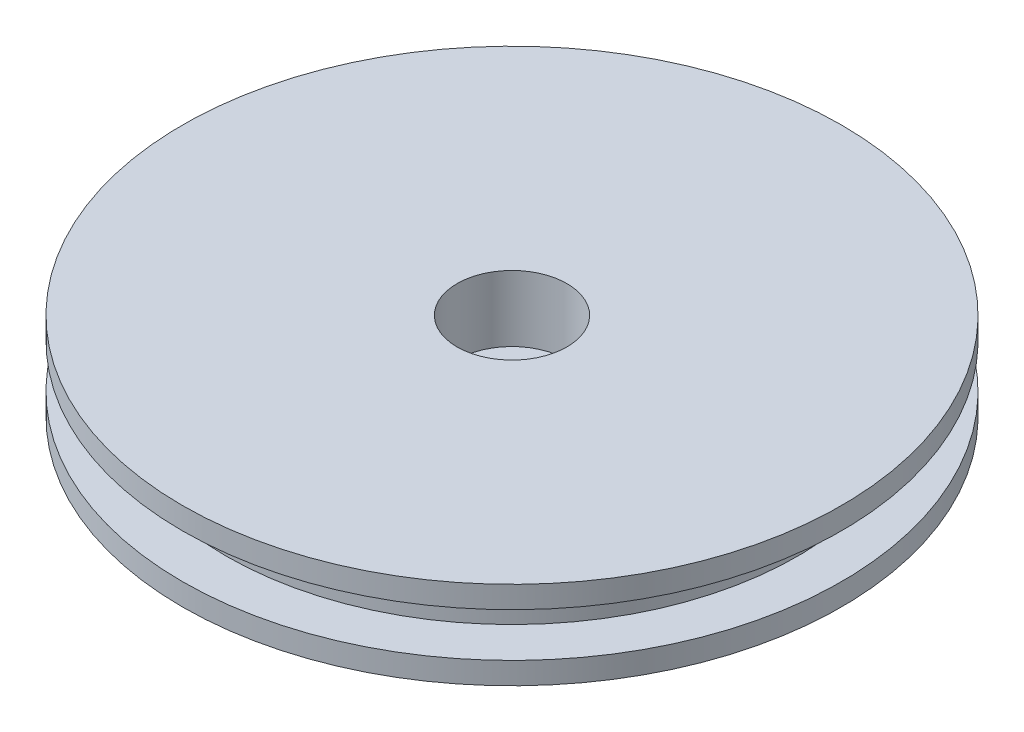
ISO-10303-21;
HEADER;
FILE_DESCRIPTION(('STEP AP214'),'2;1');
FILE_NAME('part.step','',(''),(''),'','','');
FILE_SCHEMA(('AUTOMOTIVE_DESIGN { 1 0 10303 214 1 1 1 1 }'));
ENDSEC;
DATA;
#1=APPLICATION_CONTEXT('core data for automotive mechanical design processes');
#2=APPLICATION_PROTOCOL_DEFINITION('international standard','automotive_design',2000,#1);
#3=PRODUCT_CONTEXT('',#1,'mechanical');
#4=PRODUCT('Part','Part','',(#3));
#5=PRODUCT_RELATED_PRODUCT_CATEGORY('part','',(#4));
#6=PRODUCT_DEFINITION_FORMATION('','',#4);
#7=PRODUCT_DEFINITION_CONTEXT('part definition',#1,'design');
#8=PRODUCT_DEFINITION('design','',#6,#7);
#9=PRODUCT_DEFINITION_SHAPE('','',#8);
#10=(LENGTH_UNIT() NAMED_UNIT(*) SI_UNIT(.MILLI.,.METRE.));
#11=(NAMED_UNIT(*) PLANE_ANGLE_UNIT() SI_UNIT($,.RADIAN.));
#12=(NAMED_UNIT(*) SI_UNIT($,.STERADIAN.) SOLID_ANGLE_UNIT());
#13=UNCERTAINTY_MEASURE_WITH_UNIT(LENGTH_MEASURE(1.E-05),#10,'distance_accuracy_value','');
#14=(GEOMETRIC_REPRESENTATION_CONTEXT(3) GLOBAL_UNCERTAINTY_ASSIGNED_CONTEXT((#13)) GLOBAL_UNIT_ASSIGNED_CONTEXT((#10,
#11,#12)) REPRESENTATION_CONTEXT('',''));
#15=CARTESIAN_POINT('',(0.,0.,0.));
#16=DIRECTION('',(0.,0.,1.));
#17=DIRECTION('',(1.,0.,0.));
#18=AXIS2_PLACEMENT_3D('',#15,#16,#17);
#19=CARTESIAN_POINT('',(0.,-2.,0.));
#20=DIRECTION('',(0.,-1.,0.));
#21=DIRECTION('',(0.,0.,-1.));
#22=AXIS2_PLACEMENT_3D('',#19,#20,#21);
#23=PLANE('',#22);
#24=CARTESIAN_POINT('',(0.,-2.,0.));
#25=DIRECTION('',(0.,1.,0.));
#26=DIRECTION('',(0.,0.,1.));
#27=AXIS2_PLACEMENT_3D('',#24,#25,#26);
#28=CIRCLE('',#27,1.50000000000001);
#29=CARTESIAN_POINT('',(0.,-2.,1.50000000000001));
#30=VERTEX_POINT('',#29);
#31=EDGE_CURVE('E58',#30,#30,#28,.T.);
#32=ORIENTED_EDGE('',*,*,#31,.T.);
#33=EDGE_LOOP('',(#32));
#34=FACE_BOUND('',#33,.T.);
#35=CARTESIAN_POINT('',(0.,-2.,0.));
#36=DIRECTION('',(0.,1.,0.));
#37=DIRECTION('',(0.,0.,1.));
#38=AXIS2_PLACEMENT_3D('',#35,#36,#37);
#39=CIRCLE('',#38,15.);
#40=CARTESIAN_POINT('',(0.,-2.,15.));
#41=VERTEX_POINT('',#40);
#42=EDGE_CURVE('E10',#41,#41,#39,.T.);
#43=ORIENTED_EDGE('',*,*,#42,.F.);
#44=EDGE_LOOP('',(#43));
#45=FACE_BOUND('',#44,.T.);
#46=ADVANCED_FACE('F33',(#34,#45),#23,.T.);
#47=CARTESIAN_POINT('',(0.,2.,0.));
#48=DIRECTION('',(0.,1.,0.));
#49=DIRECTION('',(0.,0.,1.));
#50=AXIS2_PLACEMENT_3D('',#47,#48,#49);
#51=CYLINDRICAL_SURFACE('',#50,15.);
#52=ORIENTED_EDGE('',*,*,#42,.T.);
#53=EDGE_LOOP('',(#52));
#54=FACE_BOUND('',#53,.T.);
#55=CARTESIAN_POINT('',(0.,-1.,0.));
#56=DIRECTION('',(0.,1.,0.));
#57=DIRECTION('',(0.,0.,1.));
#58=AXIS2_PLACEMENT_3D('',#55,#56,#57);
#59=CIRCLE('',#58,15.);
#60=CARTESIAN_POINT('',(0.,-0.999999999999998,15.));
#61=VERTEX_POINT('',#60);
#62=EDGE_CURVE('E39',#61,#61,#59,.T.);
#63=ORIENTED_EDGE('',*,*,#62,.F.);
#64=EDGE_LOOP('',(#63));
#65=FACE_BOUND('',#64,.T.);
#66=ADVANCED_FACE('F92',(#54,#65),#51,.T.);
#67=CARTESIAN_POINT('',(0.,-0.999999999999998,15.));
#68=DIRECTION('',(0.,1.,0.));
#69=DIRECTION('',(0.,0.,1.));
#70=AXIS2_PLACEMENT_3D('',#67,#68,#69);
#71=PLANE('',#70);
#72=ORIENTED_EDGE('',*,*,#62,.T.);
#73=EDGE_LOOP('',(#72));
#74=FACE_BOUND('',#73,.T.);
#75=CARTESIAN_POINT('',(0.,-1.,0.));
#76=DIRECTION('',(0.,1.,0.));
#77=DIRECTION('',(0.,0.,1.));
#78=AXIS2_PLACEMENT_3D('',#75,#76,#77);
#79=CIRCLE('',#78,13.);
#80=CARTESIAN_POINT('',(0.,-0.999999999999998,13.));
#81=VERTEX_POINT('',#80);
#82=EDGE_CURVE('E43',#81,#81,#79,.T.);
#83=ORIENTED_EDGE('',*,*,#82,.F.);
#84=EDGE_LOOP('',(#83));
#85=FACE_BOUND('',#84,.T.);
#86=ADVANCED_FACE('F97',(#74,#85),#71,.T.);
#87=CARTESIAN_POINT('',(0.,2.,0.));
#88=DIRECTION('',(0.,1.,0.));
#89=DIRECTION('',(0.,0.,1.));
#90=AXIS2_PLACEMENT_3D('',#87,#88,#89);
#91=CYLINDRICAL_SURFACE('',#90,13.);
#92=ORIENTED_EDGE('',*,*,#82,.T.);
#93=EDGE_LOOP('',(#92));
#94=FACE_BOUND('',#93,.T.);
#95=CARTESIAN_POINT('',(0.,0.999999999999995,0.));
#96=DIRECTION('',(0.,1.,0.));
#97=DIRECTION('',(0.,0.,1.));
#98=AXIS2_PLACEMENT_3D('',#95,#96,#97);
#99=CIRCLE('',#98,13.);
#100=CARTESIAN_POINT('',(0.,0.999999999999998,13.));
#101=VERTEX_POINT('',#100);
#102=EDGE_CURVE('E47',#101,#101,#99,.T.);
#103=ORIENTED_EDGE('',*,*,#102,.F.);
#104=EDGE_LOOP('',(#103));
#105=FACE_BOUND('',#104,.T.);
#106=ADVANCED_FACE('F88',(#94,#105),#91,.T.);
#107=CARTESIAN_POINT('',(0.,0.999999999999998,15.));
#108=DIRECTION('',(0.,-1.,0.));
#109=DIRECTION('',(0.,0.,-1.));
#110=AXIS2_PLACEMENT_3D('',#107,#108,#109);
#111=PLANE('',#110);
#112=ORIENTED_EDGE('',*,*,#102,.T.);
#113=EDGE_LOOP('',(#112));
#114=FACE_BOUND('',#113,.T.);
#115=CARTESIAN_POINT('',(0.,0.999999999999993,0.));
#116=DIRECTION('',(0.,1.,0.));
#117=DIRECTION('',(0.,0.,1.));
#118=AXIS2_PLACEMENT_3D('',#115,#116,#117);
#119=CIRCLE('',#118,15.);
#120=CARTESIAN_POINT('',(0.,0.999999999999997,15.));
#121=VERTEX_POINT('',#120);
#122=EDGE_CURVE('E52',#121,#121,#119,.T.);
#123=ORIENTED_EDGE('',*,*,#122,.F.);
#124=EDGE_LOOP('',(#123));
#125=FACE_BOUND('',#124,.T.);
#126=ADVANCED_FACE('F82',(#114,#125),#111,.T.);
#127=CARTESIAN_POINT('',(0.,2.,0.));
#128=DIRECTION('',(0.,1.,0.));
#129=DIRECTION('',(0.,0.,1.));
#130=AXIS2_PLACEMENT_3D('',#127,#128,#129);
#131=CYLINDRICAL_SURFACE('',#130,15.);
#132=ORIENTED_EDGE('',*,*,#122,.T.);
#133=EDGE_LOOP('',(#132));
#134=FACE_BOUND('',#133,.T.);
#135=CARTESIAN_POINT('',(0.,1.99999999999999,0.));
#136=DIRECTION('',(0.,1.,0.));
#137=DIRECTION('',(0.,0.,1.));
#138=AXIS2_PLACEMENT_3D('',#135,#136,#137);
#139=CIRCLE('',#138,15.);
#140=CARTESIAN_POINT('',(0.,2.,15.));
#141=VERTEX_POINT('',#140);
#142=EDGE_CURVE('E55',#141,#141,#139,.T.);
#143=ORIENTED_EDGE('',*,*,#142,.F.);
#144=EDGE_LOOP('',(#143));
#145=FACE_BOUND('',#144,.T.);
#146=ADVANCED_FACE('F77',(#134,#145),#131,.T.);
#147=CARTESIAN_POINT('',(0.,2.,0.));
#148=DIRECTION('',(0.,1.,0.));
#149=DIRECTION('',(0.,0.,1.));
#150=AXIS2_PLACEMENT_3D('',#147,#148,#149);
#151=PLANE('',#150);
#152=CARTESIAN_POINT('',(0.,2.,0.));
#153=DIRECTION('',(0.,1.,0.));
#154=DIRECTION('',(0.,0.,1.));
#155=AXIS2_PLACEMENT_3D('',#152,#153,#154);
#156=CIRCLE('',#155,2.50000000000001);
#157=CARTESIAN_POINT('',(0.,2.,2.50000000000001));
#158=VERTEX_POINT('',#157);
#159=EDGE_CURVE('E67',#158,#158,#156,.T.);
#160=ORIENTED_EDGE('',*,*,#159,.F.);
#161=EDGE_LOOP('',(#160));
#162=FACE_BOUND('',#161,.T.);
#163=ORIENTED_EDGE('',*,*,#142,.T.);
#164=EDGE_LOOP('',(#163));
#165=FACE_BOUND('',#164,.T.);
#166=ADVANCED_FACE('F73',(#162,#165),#151,.T.);
#167=CARTESIAN_POINT('',(0.,2.,0.));
#168=DIRECTION('',(0.,1.,0.));
#169=DIRECTION('',(0.,0.,1.));
#170=AXIS2_PLACEMENT_3D('',#167,#168,#169);
#171=CYLINDRICAL_SURFACE('',#170,1.50000000000001);
#172=ORIENTED_EDGE('',*,*,#31,.F.);
#173=EDGE_LOOP('',(#172));
#174=FACE_BOUND('',#173,.T.);
#175=CARTESIAN_POINT('',(0.,-1.,0.));
#176=DIRECTION('',(0.,1.,0.));
#177=DIRECTION('',(0.,0.,1.));
#178=AXIS2_PLACEMENT_3D('',#175,#176,#177);
#179=CIRCLE('',#178,1.50000000000001);
#180=CARTESIAN_POINT('',(0.,-1.,1.50000000000001));
#181=VERTEX_POINT('',#180);
#182=EDGE_CURVE('E61',#181,#181,#179,.T.);
#183=ORIENTED_EDGE('',*,*,#182,.T.);
#184=EDGE_LOOP('',(#183));
#185=FACE_BOUND('',#184,.T.);
#186=ADVANCED_FACE('F76',(#174,#185),#171,.F.);
#187=CARTESIAN_POINT('',(1.50000000000001,-1.,0.));
#188=DIRECTION('',(0.,-1.,0.));
#189=DIRECTION('',(0.,0.,-1.));
#190=AXIS2_PLACEMENT_3D('',#187,#188,#189);
#191=PLANE('',#190);
#192=ORIENTED_EDGE('',*,*,#182,.F.);
#193=EDGE_LOOP('',(#192));
#194=FACE_BOUND('',#193,.T.);
#195=CARTESIAN_POINT('',(0.,-1.,0.));
#196=DIRECTION('',(0.,1.,0.));
#197=DIRECTION('',(0.,0.,1.));
#198=AXIS2_PLACEMENT_3D('',#195,#196,#197);
#199=CIRCLE('',#198,2.50000000000001);
#200=CARTESIAN_POINT('',(0.,-1.,2.50000000000001));
#201=VERTEX_POINT('',#200);
#202=EDGE_CURVE('E64',#201,#201,#199,.T.);
#203=ORIENTED_EDGE('',*,*,#202,.T.);
#204=EDGE_LOOP('',(#203));
#205=FACE_BOUND('',#204,.T.);
#206=ADVANCED_FACE('F103',(#194,#205),#191,.F.);
#207=CARTESIAN_POINT('',(0.,2.,0.));
#208=DIRECTION('',(0.,1.,0.));
#209=DIRECTION('',(0.,0.,1.));
#210=AXIS2_PLACEMENT_3D('',#207,#208,#209);
#211=CYLINDRICAL_SURFACE('',#210,2.50000000000001);
#212=ORIENTED_EDGE('',*,*,#202,.F.);
#213=EDGE_LOOP('',(#212));
#214=FACE_BOUND('',#213,.T.);
#215=ORIENTED_EDGE('',*,*,#159,.T.);
#216=EDGE_LOOP('',(#215));
#217=FACE_BOUND('',#216,.T.);
#218=ADVANCED_FACE('F71',(#214,#217),#211,.F.);
#219=CLOSED_SHELL('',(#46,#66,#86,#106,#126,#146,#166,#186,#206,#218));
#220=MANIFOLD_SOLID_BREP('B2',#219);
#221=ADVANCED_BREP_SHAPE_REPRESENTATION('',(#18,#220),#14);
#222=SHAPE_DEFINITION_REPRESENTATION(#9,#221);
ENDSEC;
END-ISO-10303-21;
